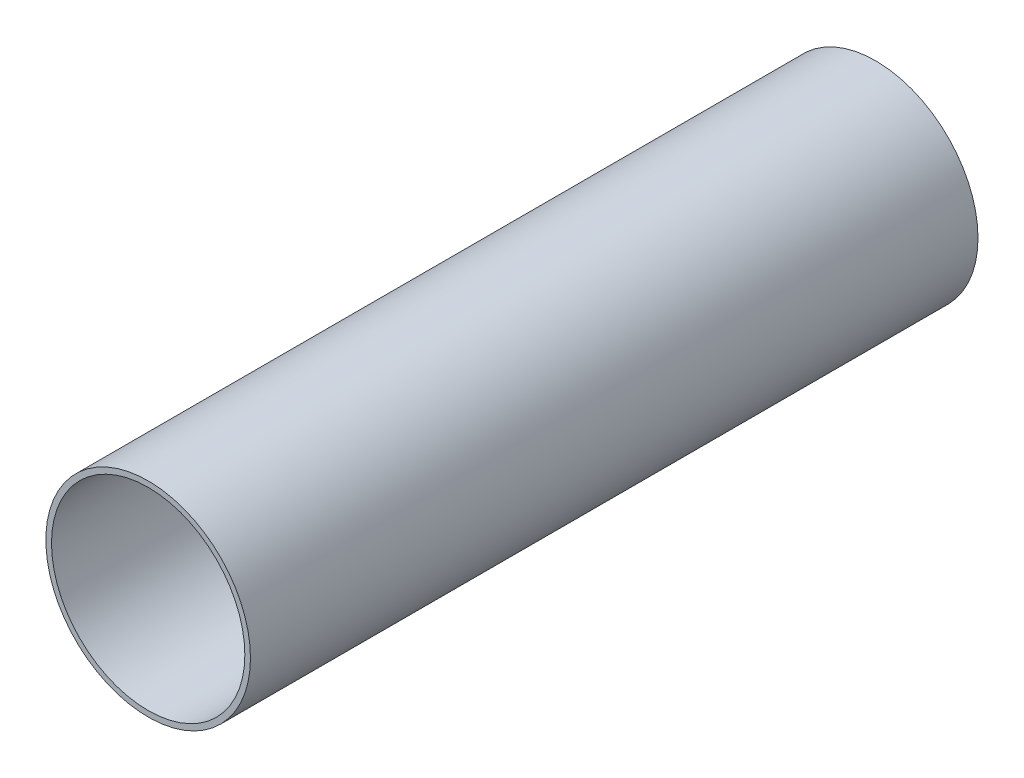
ISO-10303-21;
HEADER;
FILE_DESCRIPTION(('STEP AP214'),'2;1');
FILE_NAME('part.step','',(''),(''),'','','');
FILE_SCHEMA(('AUTOMOTIVE_DESIGN { 1 0 10303 214 1 1 1 1 }'));
ENDSEC;
DATA;
#1=APPLICATION_CONTEXT('core data for automotive mechanical design processes');
#2=APPLICATION_PROTOCOL_DEFINITION('international standard','automotive_design',2000,#1);
#3=PRODUCT_CONTEXT('',#1,'mechanical');
#4=PRODUCT('Part','Part','',(#3));
#5=PRODUCT_RELATED_PRODUCT_CATEGORY('part','',(#4));
#6=PRODUCT_DEFINITION_FORMATION('','',#4);
#7=PRODUCT_DEFINITION_CONTEXT('part definition',#1,'design');
#8=PRODUCT_DEFINITION('design','',#6,#7);
#9=PRODUCT_DEFINITION_SHAPE('','',#8);
#10=(LENGTH_UNIT() NAMED_UNIT(*) SI_UNIT(.MILLI.,.METRE.));
#11=(NAMED_UNIT(*) PLANE_ANGLE_UNIT() SI_UNIT($,.RADIAN.));
#12=(NAMED_UNIT(*) SI_UNIT($,.STERADIAN.) SOLID_ANGLE_UNIT());
#13=UNCERTAINTY_MEASURE_WITH_UNIT(LENGTH_MEASURE(1.E-05),#10,'distance_accuracy_value','');
#14=(GEOMETRIC_REPRESENTATION_CONTEXT(3) GLOBAL_UNCERTAINTY_ASSIGNED_CONTEXT((#13)) GLOBAL_UNIT_ASSIGNED_CONTEXT((#10,
#11,#12)) REPRESENTATION_CONTEXT('',''));
#15=CARTESIAN_POINT('',(0.,0.,0.));
#16=DIRECTION('',(0.,0.,1.));
#17=DIRECTION('',(1.,0.,0.));
#18=AXIS2_PLACEMENT_3D('',#15,#16,#17);
#19=CARTESIAN_POINT('',(0.,0.,101.6));
#20=DIRECTION('',(0.,0.,1.));
#21=DIRECTION('',(1.,0.,0.));
#22=AXIS2_PLACEMENT_3D('',#19,#20,#21);
#23=PLANE('',#22);
#24=CARTESIAN_POINT('',(0.,0.,101.6));
#25=DIRECTION('',(0.,0.,1.));
#26=DIRECTION('',(1.,0.,0.));
#27=AXIS2_PLACEMENT_3D('',#24,#25,#26);
#28=CIRCLE('',#27,28.575);
#29=CARTESIAN_POINT('',(28.575,0.,101.6));
#30=VERTEX_POINT('',#29);
#31=EDGE_CURVE('E10',#30,#30,#28,.T.);
#32=ORIENTED_EDGE('',*,*,#31,.T.);
#33=EDGE_LOOP('',(#32));
#34=FACE_BOUND('',#33,.T.);
#35=CARTESIAN_POINT('',(0.,0.,101.6));
#36=DIRECTION('',(0.,0.,1.));
#37=DIRECTION('',(1.,0.,0.));
#38=AXIS2_PLACEMENT_3D('',#35,#36,#37);
#39=CIRCLE('',#38,27.0002);
#40=CARTESIAN_POINT('',(27.0002,0.,101.6));
#41=VERTEX_POINT('',#40);
#42=EDGE_CURVE('E54',#41,#41,#39,.T.);
#43=ORIENTED_EDGE('',*,*,#42,.F.);
#44=EDGE_LOOP('',(#43));
#45=FACE_BOUND('',#44,.T.);
#46=ADVANCED_FACE('F43',(#34,#45),#23,.T.);
#47=CARTESIAN_POINT('',(0.,0.,-101.6));
#48=DIRECTION('',(0.,0.,1.));
#49=DIRECTION('',(1.,0.,0.));
#50=AXIS2_PLACEMENT_3D('',#47,#48,#49);
#51=PLANE('',#50);
#52=CARTESIAN_POINT('',(0.,0.,-101.6));
#53=DIRECTION('',(0.,0.,1.));
#54=DIRECTION('',(1.,0.,0.));
#55=AXIS2_PLACEMENT_3D('',#52,#53,#54);
#56=CIRCLE('',#55,28.575);
#57=CARTESIAN_POINT('',(28.575,0.,-101.6));
#58=VERTEX_POINT('',#57);
#59=EDGE_CURVE('E47',#58,#58,#56,.T.);
#60=ORIENTED_EDGE('',*,*,#59,.F.);
#61=EDGE_LOOP('',(#60));
#62=FACE_BOUND('',#61,.T.);
#63=CARTESIAN_POINT('',(0.,0.,-101.6));
#64=DIRECTION('',(0.,0.,1.));
#65=DIRECTION('',(1.,0.,0.));
#66=AXIS2_PLACEMENT_3D('',#63,#64,#65);
#67=CIRCLE('',#66,27.0002);
#68=CARTESIAN_POINT('',(27.0002,0.,-101.6));
#69=VERTEX_POINT('',#68);
#70=EDGE_CURVE('E56',#69,#69,#67,.T.);
#71=ORIENTED_EDGE('',*,*,#70,.T.);
#72=EDGE_LOOP('',(#71));
#73=FACE_BOUND('',#72,.T.);
#74=ADVANCED_FACE('F66',(#62,#73),#51,.F.);
#75=CARTESIAN_POINT('',(0.,0.,101.6));
#76=DIRECTION('',(0.,0.,-1.));
#77=DIRECTION('',(-1.,0.,0.));
#78=AXIS2_PLACEMENT_3D('',#75,#76,#77);
#79=CYLINDRICAL_SURFACE('',#78,28.575);
#80=ORIENTED_EDGE('',*,*,#31,.F.);
#81=EDGE_LOOP('',(#80));
#82=FACE_BOUND('',#81,.T.);
#83=ORIENTED_EDGE('',*,*,#59,.T.);
#84=EDGE_LOOP('',(#83));
#85=FACE_BOUND('',#84,.T.);
#86=ADVANCED_FACE('F45',(#82,#85),#79,.T.);
#87=CARTESIAN_POINT('',(0.,0.,101.6));
#88=DIRECTION('',(0.,0.,-1.));
#89=DIRECTION('',(-1.,0.,0.));
#90=AXIS2_PLACEMENT_3D('',#87,#88,#89);
#91=CYLINDRICAL_SURFACE('',#90,27.0002);
#92=ORIENTED_EDGE('',*,*,#42,.T.);
#93=EDGE_LOOP('',(#92));
#94=FACE_BOUND('',#93,.T.);
#95=ORIENTED_EDGE('',*,*,#70,.F.);
#96=EDGE_LOOP('',(#95));
#97=FACE_BOUND('',#96,.T.);
#98=ADVANCED_FACE('F62',(#94,#97),#91,.F.);
#99=CLOSED_SHELL('',(#46,#74,#86,#98));
#100=MANIFOLD_SOLID_BREP('B2',#99);
#101=ADVANCED_BREP_SHAPE_REPRESENTATION('',(#18,#100),#14);
#102=SHAPE_DEFINITION_REPRESENTATION(#9,#101);
ENDSEC;
END-ISO-10303-21;
